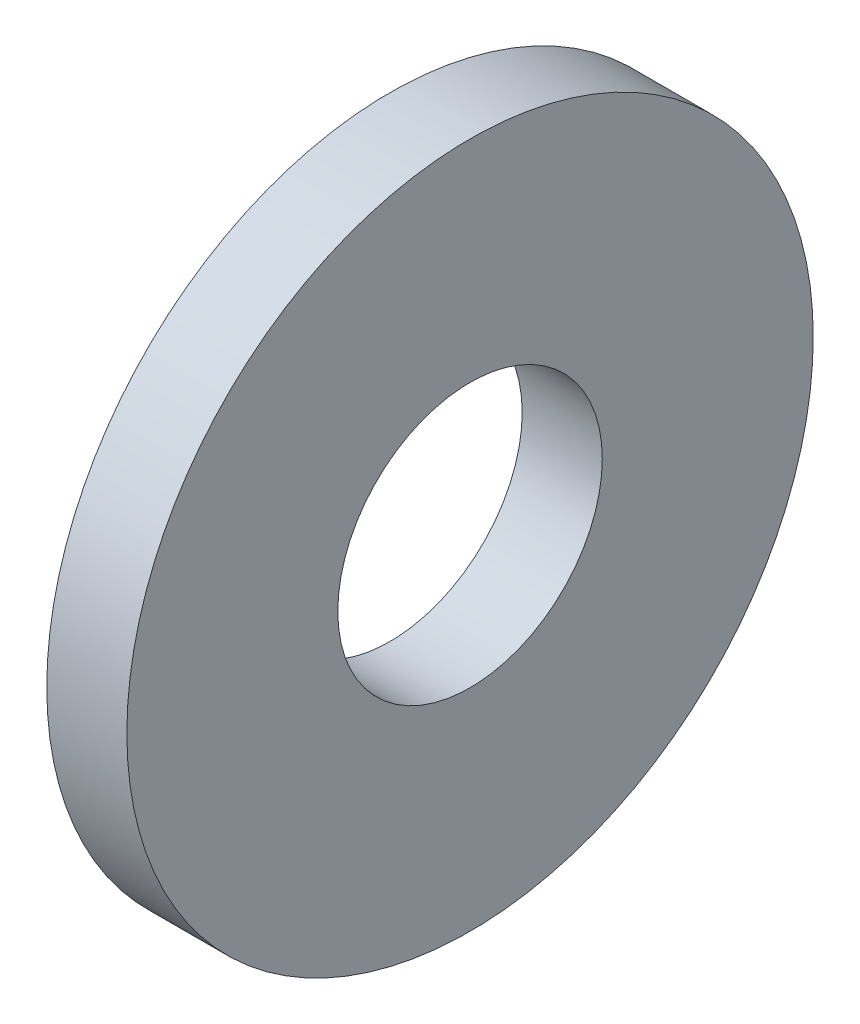
ISO-10303-21;
HEADER;
FILE_DESCRIPTION(('STEP AP214'),'2;1');
FILE_NAME('part.step','',(''),(''),'','','');
FILE_SCHEMA(('AUTOMOTIVE_DESIGN { 1 0 10303 214 1 1 1 1 }'));
ENDSEC;
DATA;
#1=APPLICATION_CONTEXT('core data for automotive mechanical design processes');
#2=APPLICATION_PROTOCOL_DEFINITION('international standard','automotive_design',2000,#1);
#3=PRODUCT_CONTEXT('',#1,'mechanical');
#4=PRODUCT('Part','Part','',(#3));
#5=PRODUCT_RELATED_PRODUCT_CATEGORY('part','',(#4));
#6=PRODUCT_DEFINITION_FORMATION('','',#4);
#7=PRODUCT_DEFINITION_CONTEXT('part definition',#1,'design');
#8=PRODUCT_DEFINITION('design','',#6,#7);
#9=PRODUCT_DEFINITION_SHAPE('','',#8);
#10=(LENGTH_UNIT() NAMED_UNIT(*) SI_UNIT(.MILLI.,.METRE.));
#11=(NAMED_UNIT(*) PLANE_ANGLE_UNIT() SI_UNIT($,.RADIAN.));
#12=(NAMED_UNIT(*) SI_UNIT($,.STERADIAN.) SOLID_ANGLE_UNIT());
#13=UNCERTAINTY_MEASURE_WITH_UNIT(LENGTH_MEASURE(1.E-05),#10,'distance_accuracy_value','');
#14=(GEOMETRIC_REPRESENTATION_CONTEXT(3) GLOBAL_UNCERTAINTY_ASSIGNED_CONTEXT((#13)) GLOBAL_UNIT_ASSIGNED_CONTEXT((#10,
#11,#12)) REPRESENTATION_CONTEXT('',''));
#15=CARTESIAN_POINT('',(0.,0.,0.));
#16=DIRECTION('',(0.,0.,1.));
#17=DIRECTION('',(1.,0.,0.));
#18=AXIS2_PLACEMENT_3D('',#15,#16,#17);
#19=CARTESIAN_POINT('',(-34.9249999999999,0.,0.));
#20=DIRECTION('',(-1.,0.,0.));
#21=DIRECTION('',(0.,0.,1.));
#22=AXIS2_PLACEMENT_3D('',#19,#20,#21);
#23=CYLINDRICAL_SURFACE('',#22,2.89);
#24=CARTESIAN_POINT('',(0.,0.,0.));
#25=DIRECTION('',(-1.,0.,0.));
#26=DIRECTION('',(0.,0.,1.));
#27=AXIS2_PLACEMENT_3D('',#24,#25,#26);
#28=CIRCLE('',#27,2.89);
#29=CARTESIAN_POINT('',(0.,0.,2.89));
#30=VERTEX_POINT('',#29);
#31=EDGE_CURVE('E10',#30,#30,#28,.T.);
#32=ORIENTED_EDGE('',*,*,#31,.F.);
#33=EDGE_LOOP('',(#32));
#34=FACE_BOUND('',#33,.T.);
#35=CARTESIAN_POINT('',(-1.75,0.,0.));
#36=DIRECTION('',(-1.,0.,0.));
#37=DIRECTION('',(0.,0.,1.));
#38=AXIS2_PLACEMENT_3D('',#35,#36,#37);
#39=CIRCLE('',#38,2.89);
#40=CARTESIAN_POINT('',(-1.75,0.,2.89));
#41=VERTEX_POINT('',#40);
#42=EDGE_CURVE('E47',#41,#41,#39,.T.);
#43=ORIENTED_EDGE('',*,*,#42,.T.);
#44=EDGE_LOOP('',(#43));
#45=FACE_BOUND('',#44,.T.);
#46=ADVANCED_FACE('F33',(#34,#45),#23,.F.);
#47=CARTESIAN_POINT('',(0.,2.89,0.));
#48=DIRECTION('',(-1.,0.,0.));
#49=DIRECTION('',(0.,0.,1.));
#50=AXIS2_PLACEMENT_3D('',#47,#48,#49);
#51=PLANE('',#50);
#52=CARTESIAN_POINT('',(0.,0.,0.));
#53=DIRECTION('',(-1.,0.,0.));
#54=DIRECTION('',(0.,0.,1.));
#55=AXIS2_PLACEMENT_3D('',#52,#53,#54);
#56=CIRCLE('',#55,7.5);
#57=CARTESIAN_POINT('',(0.,0.,7.5));
#58=VERTEX_POINT('',#57);
#59=EDGE_CURVE('E39',#58,#58,#56,.T.);
#60=ORIENTED_EDGE('',*,*,#59,.F.);
#61=EDGE_LOOP('',(#60));
#62=FACE_BOUND('',#61,.T.);
#63=ORIENTED_EDGE('',*,*,#31,.T.);
#64=EDGE_LOOP('',(#63));
#65=FACE_BOUND('',#64,.T.);
#66=ADVANCED_FACE('F62',(#62,#65),#51,.F.);
#67=CARTESIAN_POINT('',(-34.9249999999999,0.,0.));
#68=DIRECTION('',(-1.,0.,0.));
#69=DIRECTION('',(0.,0.,1.));
#70=AXIS2_PLACEMENT_3D('',#67,#68,#69);
#71=CYLINDRICAL_SURFACE('',#70,7.5);
#72=CARTESIAN_POINT('',(-1.75,0.,0.));
#73=DIRECTION('',(-1.,0.,0.));
#74=DIRECTION('',(0.,0.,1.));
#75=AXIS2_PLACEMENT_3D('',#72,#73,#74);
#76=CIRCLE('',#75,7.5);
#77=CARTESIAN_POINT('',(-1.75,0.,7.5));
#78=VERTEX_POINT('',#77);
#79=EDGE_CURVE('E43',#78,#78,#76,.T.);
#80=ORIENTED_EDGE('',*,*,#79,.F.);
#81=EDGE_LOOP('',(#80));
#82=FACE_BOUND('',#81,.T.);
#83=ORIENTED_EDGE('',*,*,#59,.T.);
#84=EDGE_LOOP('',(#83));
#85=FACE_BOUND('',#84,.T.);
#86=ADVANCED_FACE('F57',(#82,#85),#71,.T.);
#87=CARTESIAN_POINT('',(-1.75,7.5,0.));
#88=DIRECTION('',(1.,0.,0.));
#89=DIRECTION('',(0.,0.,-1.));
#90=AXIS2_PLACEMENT_3D('',#87,#88,#89);
#91=PLANE('',#90);
#92=ORIENTED_EDGE('',*,*,#42,.F.);
#93=EDGE_LOOP('',(#92));
#94=FACE_BOUND('',#93,.T.);
#95=ORIENTED_EDGE('',*,*,#79,.T.);
#96=EDGE_LOOP('',(#95));
#97=FACE_BOUND('',#96,.T.);
#98=ADVANCED_FACE('F54',(#94,#97),#91,.F.);
#99=CLOSED_SHELL('',(#46,#66,#86,#98));
#100=MANIFOLD_SOLID_BREP('B2',#99);
#101=ADVANCED_BREP_SHAPE_REPRESENTATION('',(#18,#100),#14);
#102=SHAPE_DEFINITION_REPRESENTATION(#9,#101);
ENDSEC;
END-ISO-10303-21;
